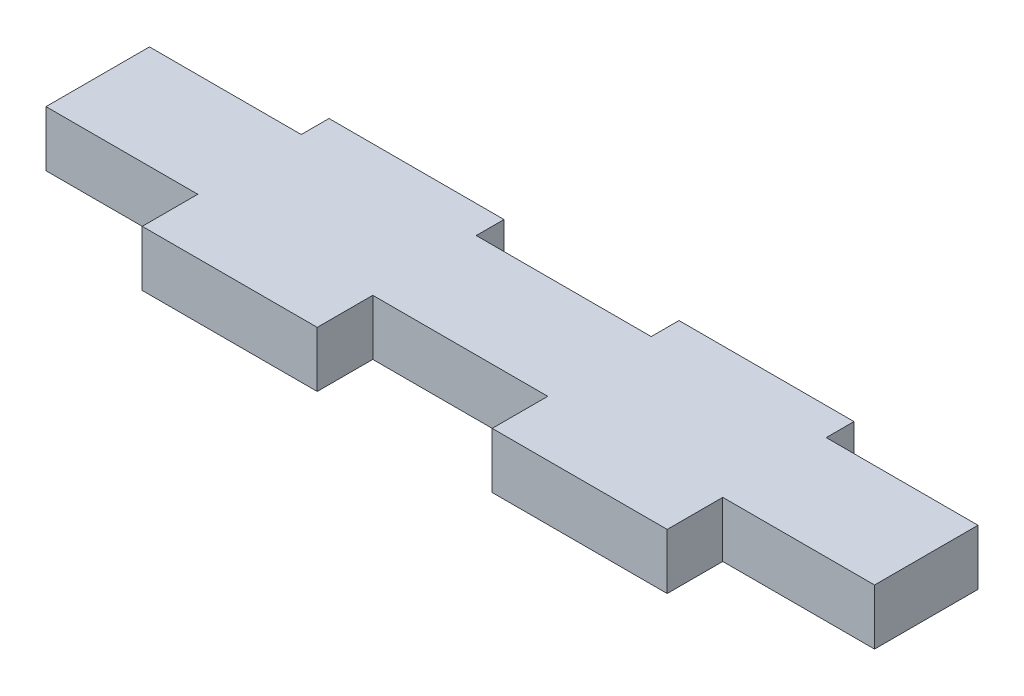
ISO-10303-21;
HEADER;
FILE_DESCRIPTION(('STEP AP214'),'2;1');
FILE_NAME('part.step','',(''),(''),'','','');
FILE_SCHEMA(('AUTOMOTIVE_DESIGN { 1 0 10303 214 1 1 1 1 }'));
ENDSEC;
DATA;
#1=APPLICATION_CONTEXT('core data for automotive mechanical design processes');
#2=APPLICATION_PROTOCOL_DEFINITION('international standard','automotive_design',2000,#1);
#3=PRODUCT_CONTEXT('',#1,'mechanical');
#4=PRODUCT('Part','Part','',(#3));
#5=PRODUCT_RELATED_PRODUCT_CATEGORY('part','',(#4));
#6=PRODUCT_DEFINITION_FORMATION('','',#4);
#7=PRODUCT_DEFINITION_CONTEXT('part definition',#1,'design');
#8=PRODUCT_DEFINITION('design','',#6,#7);
#9=PRODUCT_DEFINITION_SHAPE('','',#8);
#10=(LENGTH_UNIT() NAMED_UNIT(*) SI_UNIT(.MILLI.,.METRE.));
#11=(NAMED_UNIT(*) PLANE_ANGLE_UNIT() SI_UNIT($,.RADIAN.));
#12=(NAMED_UNIT(*) SI_UNIT($,.STERADIAN.) SOLID_ANGLE_UNIT());
#13=UNCERTAINTY_MEASURE_WITH_UNIT(LENGTH_MEASURE(1.E-05),#10,'distance_accuracy_value','');
#14=(GEOMETRIC_REPRESENTATION_CONTEXT(3) GLOBAL_UNCERTAINTY_ASSIGNED_CONTEXT((#13)) GLOBAL_UNIT_ASSIGNED_CONTEXT((#10,
#11,#12)) REPRESENTATION_CONTEXT('',''));
#15=CARTESIAN_POINT('',(0.,0.,0.));
#16=DIRECTION('',(0.,0.,1.));
#17=DIRECTION('',(1.,0.,0.));
#18=AXIS2_PLACEMENT_3D('',#15,#16,#17);
#19=CARTESIAN_POINT('',(0.,3.175,0.));
#20=DIRECTION('',(0.,0.,-1.));
#21=DIRECTION('',(-1.,0.,0.));
#22=AXIS2_PLACEMENT_3D('',#19,#20,#21);
#23=PLANE('',#22);
#24=DIRECTION('',(1.,0.,0.));
#25=VECTOR('',#24,1.);
#26=CARTESIAN_POINT('',(0.,3.175,0.));
#27=LINE('',#26,#25);
#28=CARTESIAN_POINT('',(28.6749999999999,3.175,0.));
#29=VERTEX_POINT('',#28);
#30=CARTESIAN_POINT('',(38.6749999999999,3.175,0.));
#31=VERTEX_POINT('',#30);
#32=EDGE_CURVE('E187',#29,#31,#27,.T.);
#33=ORIENTED_EDGE('',*,*,#32,.F.);
#34=DIRECTION('',(0.,-1.,0.));
#35=VECTOR('',#34,1.);
#36=CARTESIAN_POINT('',(28.6749999999999,3.175,0.));
#37=LINE('',#36,#35);
#38=CARTESIAN_POINT('',(28.6749999999999,0.,0.));
#39=VERTEX_POINT('',#38);
#40=EDGE_CURVE('E171',#29,#39,#37,.T.);
#41=ORIENTED_EDGE('',*,*,#40,.T.);
#42=DIRECTION('',(1.,0.,0.));
#43=VECTOR('',#42,1.);
#44=CARTESIAN_POINT('',(0.,0.,0.));
#45=LINE('',#44,#43);
#46=CARTESIAN_POINT('',(38.6749999999999,0.,0.));
#47=VERTEX_POINT('',#46);
#48=EDGE_CURVE('E213',#39,#47,#45,.T.);
#49=ORIENTED_EDGE('',*,*,#48,.T.);
#50=DIRECTION('',(0.,-1.,0.));
#51=VECTOR('',#50,1.);
#52=CARTESIAN_POINT('',(38.6749999999999,3.175,0.));
#53=LINE('',#52,#51);
#54=EDGE_CURVE('E196',#31,#47,#53,.T.);
#55=ORIENTED_EDGE('',*,*,#54,.F.);
#56=EDGE_LOOP('',(#33,#41,#49,#55));
#57=FACE_BOUND('',#56,.T.);
#58=ADVANCED_FACE('F32',(#57),#23,.F.);
#59=CARTESIAN_POINT('',(0.,3.175,-10.675));
#60=DIRECTION('',(0.,0.,1.));
#61=DIRECTION('',(1.,0.,0.));
#62=AXIS2_PLACEMENT_3D('',#59,#60,#61);
#63=PLANE('',#62);
#64=DIRECTION('',(-1.,0.,0.));
#65=VECTOR('',#64,1.);
#66=CARTESIAN_POINT('',(0.,3.175,-10.675));
#67=LINE('',#66,#65);
#68=CARTESIAN_POINT('',(38.6749999999999,3.175,-10.675));
#69=VERTEX_POINT('',#68);
#70=CARTESIAN_POINT('',(28.6749999999999,3.175,-10.675));
#71=VERTEX_POINT('',#70);
#72=EDGE_CURVE('E11',#69,#71,#67,.T.);
#73=ORIENTED_EDGE('',*,*,#72,.F.);
#74=DIRECTION('',(0.,-1.,0.));
#75=VECTOR('',#74,1.);
#76=CARTESIAN_POINT('',(38.6749999999999,3.175,-10.675));
#77=LINE('',#76,#75);
#78=CARTESIAN_POINT('',(38.6749999999999,0.,-10.675));
#79=VERTEX_POINT('',#78);
#80=EDGE_CURVE('E262',#69,#79,#77,.T.);
#81=ORIENTED_EDGE('',*,*,#80,.T.);
#82=DIRECTION('',(-1.,0.,0.));
#83=VECTOR('',#82,1.);
#84=CARTESIAN_POINT('',(0.,0.,-10.675));
#85=LINE('',#84,#83);
#86=CARTESIAN_POINT('',(28.6749999999999,0.,-10.675));
#87=VERTEX_POINT('',#86);
#88=EDGE_CURVE('E203',#79,#87,#85,.T.);
#89=ORIENTED_EDGE('',*,*,#88,.T.);
#90=DIRECTION('',(0.,-1.,0.));
#91=VECTOR('',#90,1.);
#92=CARTESIAN_POINT('',(28.6749999999999,3.175,-10.675));
#93=LINE('',#92,#91);
#94=EDGE_CURVE('E280',#71,#87,#93,.T.);
#95=ORIENTED_EDGE('',*,*,#94,.F.);
#96=EDGE_LOOP('',(#73,#81,#89,#95));
#97=FACE_BOUND('',#96,.T.);
#98=ADVANCED_FACE('F357',(#97),#63,.F.);
#99=CARTESIAN_POINT('',(0.,3.175,0.));
#100=DIRECTION('',(1.,0.,0.));
#101=DIRECTION('',(0.,0.,-1.));
#102=AXIS2_PLACEMENT_3D('',#99,#100,#101);
#103=PLANE('',#102);
#104=DIRECTION('',(0.,0.,1.));
#105=VECTOR('',#104,1.);
#106=CARTESIAN_POINT('',(0.,0.,0.));
#107=LINE('',#106,#105);
#108=CARTESIAN_POINT('',(0.,0.,-9.0875000000001));
#109=VERTEX_POINT('',#108);
#110=CARTESIAN_POINT('',(0.,0.,-3.17499999999978));
#111=VERTEX_POINT('',#110);
#112=EDGE_CURVE('E210',#109,#111,#107,.T.);
#113=ORIENTED_EDGE('',*,*,#112,.T.);
#114=DIRECTION('',(0.,-1.,0.));
#115=VECTOR('',#114,1.);
#116=CARTESIAN_POINT('',(0.,3.175,-3.17499999999979));
#117=LINE('',#116,#115);
#118=CARTESIAN_POINT('',(0.,3.175,-3.17499999999979));
#119=VERTEX_POINT('',#118);
#120=EDGE_CURVE('E266',#119,#111,#117,.T.);
#121=ORIENTED_EDGE('',*,*,#120,.F.);
#122=DIRECTION('',(0.,0.,1.));
#123=VECTOR('',#122,1.);
#124=CARTESIAN_POINT('',(0.,3.175,0.));
#125=LINE('',#124,#123);
#126=CARTESIAN_POINT('',(0.,3.175,-9.0875000000001));
#127=VERTEX_POINT('',#126);
#128=EDGE_CURVE('E198',#127,#119,#125,.T.);
#129=ORIENTED_EDGE('',*,*,#128,.F.);
#130=DIRECTION('',(0.,-1.,0.));
#131=VECTOR('',#130,1.);
#132=CARTESIAN_POINT('',(0.,3.175,-9.0875000000001));
#133=LINE('',#132,#131);
#134=EDGE_CURVE('E322',#127,#109,#133,.T.);
#135=ORIENTED_EDGE('',*,*,#134,.T.);
#136=EDGE_LOOP('',(#113,#121,#129,#135));
#137=FACE_BOUND('',#136,.T.);
#138=ADVANCED_FACE('F34',(#137),#103,.F.);
#139=CARTESIAN_POINT('',(8.6749999999999,0.,0.));
#140=VERTEX_POINT('',#139);
#141=CARTESIAN_POINT('',(18.6749999999999,0.,0.));
#142=VERTEX_POINT('',#141);
#143=EDGE_CURVE('E215',#140,#142,#45,.T.);
#144=ORIENTED_EDGE('',*,*,#143,.T.);
#145=DIRECTION('',(0.,-1.,0.));
#146=VECTOR('',#145,1.);
#147=CARTESIAN_POINT('',(18.6749999999999,3.175,0.));
#148=LINE('',#147,#146);
#149=CARTESIAN_POINT('',(18.6749999999999,3.175,0.));
#150=VERTEX_POINT('',#149);
#151=EDGE_CURVE('E181',#150,#142,#148,.T.);
#152=ORIENTED_EDGE('',*,*,#151,.F.);
#153=CARTESIAN_POINT('',(8.6749999999999,3.175,0.));
#154=VERTEX_POINT('',#153);
#155=EDGE_CURVE('E197',#154,#150,#27,.T.);
#156=ORIENTED_EDGE('',*,*,#155,.F.);
#157=DIRECTION('',(0.,-1.,0.));
#158=VECTOR('',#157,1.);
#159=CARTESIAN_POINT('',(8.6749999999999,3.175,0.));
#160=LINE('',#159,#158);
#161=EDGE_CURVE('E230',#154,#140,#160,.T.);
#162=ORIENTED_EDGE('',*,*,#161,.T.);
#163=EDGE_LOOP('',(#144,#152,#156,#162));
#164=FACE_BOUND('',#163,.T.);
#165=ADVANCED_FACE('F228',(#164),#23,.F.);
#166=CARTESIAN_POINT('',(47.35,3.175,0.));
#167=DIRECTION('',(-1.,0.,0.));
#168=DIRECTION('',(0.,0.,1.));
#169=AXIS2_PLACEMENT_3D('',#166,#167,#168);
#170=PLANE('',#169);
#171=DIRECTION('',(0.,0.,-1.));
#172=VECTOR('',#171,1.);
#173=CARTESIAN_POINT('',(47.35,0.,0.));
#174=LINE('',#173,#172);
#175=CARTESIAN_POINT('',(47.35,0.,-3.17499999999989));
#176=VERTEX_POINT('',#175);
#177=CARTESIAN_POINT('',(47.35,0.,-9.08750000000009));
#178=VERTEX_POINT('',#177);
#179=EDGE_CURVE('E216',#176,#178,#174,.T.);
#180=ORIENTED_EDGE('',*,*,#179,.T.);
#181=DIRECTION('',(0.,-1.,0.));
#182=VECTOR('',#181,1.);
#183=CARTESIAN_POINT('',(47.35,3.175,-9.0875000000001));
#184=LINE('',#183,#182);
#185=CARTESIAN_POINT('',(47.35,3.175,-9.0875000000001));
#186=VERTEX_POINT('',#185);
#187=EDGE_CURVE('E276',#186,#178,#184,.T.);
#188=ORIENTED_EDGE('',*,*,#187,.F.);
#189=DIRECTION('',(0.,0.,-1.));
#190=VECTOR('',#189,1.);
#191=CARTESIAN_POINT('',(47.35,3.175,0.));
#192=LINE('',#191,#190);
#193=CARTESIAN_POINT('',(47.35,3.175,-3.17499999999989));
#194=VERTEX_POINT('',#193);
#195=EDGE_CURVE('E201',#194,#186,#192,.T.);
#196=ORIENTED_EDGE('',*,*,#195,.F.);
#197=DIRECTION('',(0.,-1.,0.));
#198=VECTOR('',#197,1.);
#199=CARTESIAN_POINT('',(47.35,3.175,-3.17499999999989));
#200=LINE('',#199,#198);
#201=EDGE_CURVE('E214',#194,#176,#200,.T.);
#202=ORIENTED_EDGE('',*,*,#201,.T.);
#203=EDGE_LOOP('',(#180,#188,#196,#202));
#204=FACE_BOUND('',#203,.T.);
#205=ADVANCED_FACE('F346',(#204),#170,.F.);
#206=CARTESIAN_POINT('',(18.6749999999999,3.175,-10.675));
#207=VERTEX_POINT('',#206);
#208=CARTESIAN_POINT('',(8.6749999999999,3.175,-10.675));
#209=VERTEX_POINT('',#208);
#210=EDGE_CURVE('E41',#207,#209,#67,.T.);
#211=ORIENTED_EDGE('',*,*,#210,.F.);
#212=DIRECTION('',(0.,-1.,0.));
#213=VECTOR('',#212,1.);
#214=CARTESIAN_POINT('',(18.6749999999999,3.175,-10.675));
#215=LINE('',#214,#213);
#216=CARTESIAN_POINT('',(18.6749999999999,0.,-10.675));
#217=VERTEX_POINT('',#216);
#218=EDGE_CURVE('E305',#207,#217,#215,.T.);
#219=ORIENTED_EDGE('',*,*,#218,.T.);
#220=CARTESIAN_POINT('',(8.6749999999999,0.,-10.675));
#221=VERTEX_POINT('',#220);
#222=EDGE_CURVE('E36',#217,#221,#85,.T.);
#223=ORIENTED_EDGE('',*,*,#222,.T.);
#224=DIRECTION('',(0.,-1.,0.));
#225=VECTOR('',#224,1.);
#226=CARTESIAN_POINT('',(8.6749999999999,3.175,-10.675));
#227=LINE('',#226,#225);
#228=EDGE_CURVE('E300',#209,#221,#227,.T.);
#229=ORIENTED_EDGE('',*,*,#228,.F.);
#230=EDGE_LOOP('',(#211,#219,#223,#229));
#231=FACE_BOUND('',#230,.T.);
#232=ADVANCED_FACE('F371',(#231),#63,.F.);
#233=CARTESIAN_POINT('',(0.,3.175,0.));
#234=DIRECTION('',(0.,-1.,0.));
#235=DIRECTION('',(0.,0.,-1.));
#236=AXIS2_PLACEMENT_3D('',#233,#234,#235);
#237=PLANE('',#236);
#238=DIRECTION('',(1.,0.,0.));
#239=VECTOR('',#238,1.);
#240=CARTESIAN_POINT('',(28.6749999999999,3.175,-3.17499999999982));
#241=LINE('',#240,#239);
#242=CARTESIAN_POINT('',(18.6749999999999,3.175,-3.17499999999982));
#243=VERTEX_POINT('',#242);
#244=CARTESIAN_POINT('',(28.6749999999999,3.175,-3.17499999999982));
#245=VERTEX_POINT('',#244);
#246=EDGE_CURVE('E182',#243,#245,#241,.T.);
#247=ORIENTED_EDGE('',*,*,#246,.T.);
#248=DIRECTION('',(0.,0.,1.));
#249=VECTOR('',#248,1.);
#250=CARTESIAN_POINT('',(28.6749999999999,3.175,0.));
#251=LINE('',#250,#249);
#252=EDGE_CURVE('E174',#245,#29,#251,.T.);
#253=ORIENTED_EDGE('',*,*,#252,.T.);
#254=ORIENTED_EDGE('',*,*,#32,.T.);
#255=DIRECTION('',(0.,0.,-1.));
#256=VECTOR('',#255,1.);
#257=CARTESIAN_POINT('',(38.6749999999999,3.175,0.));
#258=LINE('',#257,#256);
#259=CARTESIAN_POINT('',(38.6749999999999,3.175,-3.17499999999989));
#260=VERTEX_POINT('',#259);
#261=EDGE_CURVE('E326',#31,#260,#258,.T.);
#262=ORIENTED_EDGE('',*,*,#261,.T.);
#263=DIRECTION('',(1.,0.,0.));
#264=VECTOR('',#263,1.);
#265=CARTESIAN_POINT('',(47.35,3.175,-3.17499999999989));
#266=LINE('',#265,#264);
#267=EDGE_CURVE('E328',#260,#194,#266,.T.);
#268=ORIENTED_EDGE('',*,*,#267,.T.);
#269=ORIENTED_EDGE('',*,*,#195,.T.);
#270=DIRECTION('',(-1.,0.,0.));
#271=VECTOR('',#270,1.);
#272=CARTESIAN_POINT('',(47.35,3.175,-9.0875000000001));
#273=LINE('',#272,#271);
#274=CARTESIAN_POINT('',(38.6749999999999,3.175,-9.0875000000001));
#275=VERTEX_POINT('',#274);
#276=EDGE_CURVE('E269',#186,#275,#273,.T.);
#277=ORIENTED_EDGE('',*,*,#276,.T.);
#278=DIRECTION('',(0.,0.,-1.));
#279=VECTOR('',#278,1.);
#280=CARTESIAN_POINT('',(38.6749999999999,3.175,-10.675));
#281=LINE('',#280,#279);
#282=EDGE_CURVE('E272',#275,#69,#281,.T.);
#283=ORIENTED_EDGE('',*,*,#282,.T.);
#284=ORIENTED_EDGE('',*,*,#72,.T.);
#285=DIRECTION('',(0.,0.,1.));
#286=VECTOR('',#285,1.);
#287=CARTESIAN_POINT('',(28.6749999999999,3.175,-10.675));
#288=LINE('',#287,#286);
#289=CARTESIAN_POINT('',(28.6749999999999,3.175,-9.0875000000001));
#290=VERTEX_POINT('',#289);
#291=EDGE_CURVE('E287',#71,#290,#288,.T.);
#292=ORIENTED_EDGE('',*,*,#291,.T.);
#293=DIRECTION('',(-1.,0.,0.));
#294=VECTOR('',#293,1.);
#295=CARTESIAN_POINT('',(28.6749999999999,3.175,-9.0875000000001));
#296=LINE('',#295,#294);
#297=CARTESIAN_POINT('',(18.6749999999999,3.175,-9.0875000000001));
#298=VERTEX_POINT('',#297);
#299=EDGE_CURVE('E290',#290,#298,#296,.T.);
#300=ORIENTED_EDGE('',*,*,#299,.T.);
#301=DIRECTION('',(0.,0.,-1.));
#302=VECTOR('',#301,1.);
#303=CARTESIAN_POINT('',(18.6749999999999,3.175,-10.675));
#304=LINE('',#303,#302);
#305=EDGE_CURVE('E294',#298,#207,#304,.T.);
#306=ORIENTED_EDGE('',*,*,#305,.T.);
#307=ORIENTED_EDGE('',*,*,#210,.T.);
#308=DIRECTION('',(0.,0.,1.));
#309=VECTOR('',#308,1.);
#310=CARTESIAN_POINT('',(8.6749999999999,3.175,-10.675));
#311=LINE('',#310,#309);
#312=CARTESIAN_POINT('',(8.6749999999999,3.175,-9.0875000000001));
#313=VERTEX_POINT('',#312);
#314=EDGE_CURVE('E311',#209,#313,#311,.T.);
#315=ORIENTED_EDGE('',*,*,#314,.T.);
#316=DIRECTION('',(-1.,0.,0.));
#317=VECTOR('',#316,1.);
#318=CARTESIAN_POINT('',(8.6749999999999,3.175,-9.0875000000001));
#319=LINE('',#318,#317);
#320=EDGE_CURVE('E314',#313,#127,#319,.T.);
#321=ORIENTED_EDGE('',*,*,#320,.T.);
#322=ORIENTED_EDGE('',*,*,#128,.T.);
#323=DIRECTION('',(1.,0.,0.));
#324=VECTOR('',#323,1.);
#325=CARTESIAN_POINT('',(8.6749999999999,3.175,-3.17499999999979));
#326=LINE('',#325,#324);
#327=CARTESIAN_POINT('',(8.6749999999999,3.175,-3.17499999999979));
#328=VERTEX_POINT('',#327);
#329=EDGE_CURVE('E257',#119,#328,#326,.T.);
#330=ORIENTED_EDGE('',*,*,#329,.T.);
#331=DIRECTION('',(0.,0.,1.));
#332=VECTOR('',#331,1.);
#333=CARTESIAN_POINT('',(8.6749999999999,3.175,-3.17499999999979));
#334=LINE('',#333,#332);
#335=EDGE_CURVE('E254',#328,#154,#334,.T.);
#336=ORIENTED_EDGE('',*,*,#335,.T.);
#337=ORIENTED_EDGE('',*,*,#155,.T.);
#338=DIRECTION('',(0.,0.,-1.));
#339=VECTOR('',#338,1.);
#340=CARTESIAN_POINT('',(18.6749999999999,3.175,0.));
#341=LINE('',#340,#339);
#342=EDGE_CURVE('E191',#150,#243,#341,.T.);
#343=ORIENTED_EDGE('',*,*,#342,.T.);
#344=EDGE_LOOP('',(#247,#253,#254,#262,#268,#269,#277,#283,#284,#292,#300,#306,#307,#315,#321,
#322,#330,#336,#337,#343));
#345=FACE_BOUND('',#344,.T.);
#346=ADVANCED_FACE('F185',(#345),#237,.F.);
#347=CARTESIAN_POINT('',(0.,0.,0.));
#348=DIRECTION('',(0.,-1.,0.));
#349=DIRECTION('',(0.,0.,-1.));
#350=AXIS2_PLACEMENT_3D('',#347,#348,#349);
#351=PLANE('',#350);
#352=DIRECTION('',(0.,0.,1.));
#353=VECTOR('',#352,1.);
#354=CARTESIAN_POINT('',(28.6749999999999,0.,0.));
#355=LINE('',#354,#353);
#356=CARTESIAN_POINT('',(28.6749999999999,0.,-3.17499999999982));
#357=VERTEX_POINT('',#356);
#358=EDGE_CURVE('E177',#357,#39,#355,.T.);
#359=ORIENTED_EDGE('',*,*,#358,.F.);
#360=DIRECTION('',(1.,0.,0.));
#361=VECTOR('',#360,1.);
#362=CARTESIAN_POINT('',(28.6749999999999,0.,-3.17499999999982));
#363=LINE('',#362,#361);
#364=CARTESIAN_POINT('',(18.6749999999999,0.,-3.17499999999982));
#365=VERTEX_POINT('',#364);
#366=EDGE_CURVE('E192',#365,#357,#363,.T.);
#367=ORIENTED_EDGE('',*,*,#366,.F.);
#368=DIRECTION('',(0.,0.,-1.));
#369=VECTOR('',#368,1.);
#370=CARTESIAN_POINT('',(18.6749999999999,0.,0.));
#371=LINE('',#370,#369);
#372=EDGE_CURVE('E239',#142,#365,#371,.T.);
#373=ORIENTED_EDGE('',*,*,#372,.F.);
#374=ORIENTED_EDGE('',*,*,#143,.F.);
#375=DIRECTION('',(0.,0.,1.));
#376=VECTOR('',#375,1.);
#377=CARTESIAN_POINT('',(8.6749999999999,0.,-3.17499999999979));
#378=LINE('',#377,#376);
#379=CARTESIAN_POINT('',(8.6749999999999,0.,-3.17499999999979));
#380=VERTEX_POINT('',#379);
#381=EDGE_CURVE('E236',#380,#140,#378,.T.);
#382=ORIENTED_EDGE('',*,*,#381,.F.);
#383=DIRECTION('',(1.,0.,0.));
#384=VECTOR('',#383,1.);
#385=CARTESIAN_POINT('',(8.6749999999999,0.,-3.17499999999979));
#386=LINE('',#385,#384);
#387=EDGE_CURVE('E258',#111,#380,#386,.T.);
#388=ORIENTED_EDGE('',*,*,#387,.F.);
#389=ORIENTED_EDGE('',*,*,#112,.F.);
#390=DIRECTION('',(-1.,0.,0.));
#391=VECTOR('',#390,1.);
#392=CARTESIAN_POINT('',(8.6749999999999,0.,-9.0875000000001));
#393=LINE('',#392,#391);
#394=CARTESIAN_POINT('',(8.6749999999999,0.,-9.0875000000001));
#395=VERTEX_POINT('',#394);
#396=EDGE_CURVE('E315',#395,#109,#393,.T.);
#397=ORIENTED_EDGE('',*,*,#396,.F.);
#398=DIRECTION('',(0.,0.,1.));
#399=VECTOR('',#398,1.);
#400=CARTESIAN_POINT('',(8.6749999999999,0.,-10.675));
#401=LINE('',#400,#399);
#402=EDGE_CURVE('E57',#221,#395,#401,.T.);
#403=ORIENTED_EDGE('',*,*,#402,.F.);
#404=ORIENTED_EDGE('',*,*,#222,.F.);
#405=DIRECTION('',(0.,0.,-1.));
#406=VECTOR('',#405,1.);
#407=CARTESIAN_POINT('',(18.6749999999999,0.,-10.675));
#408=LINE('',#407,#406);
#409=CARTESIAN_POINT('',(18.6749999999999,0.,-9.0875000000001));
#410=VERTEX_POINT('',#409);
#411=EDGE_CURVE('E291',#410,#217,#408,.T.);
#412=ORIENTED_EDGE('',*,*,#411,.F.);
#413=DIRECTION('',(-1.,0.,0.));
#414=VECTOR('',#413,1.);
#415=CARTESIAN_POINT('',(28.6749999999999,0.,-9.0875000000001));
#416=LINE('',#415,#414);
#417=CARTESIAN_POINT('',(28.6749999999999,0.,-9.0875000000001));
#418=VERTEX_POINT('',#417);
#419=EDGE_CURVE('E299',#418,#410,#416,.T.);
#420=ORIENTED_EDGE('',*,*,#419,.F.);
#421=DIRECTION('',(0.,0.,1.));
#422=VECTOR('',#421,1.);
#423=CARTESIAN_POINT('',(28.6749999999999,0.,-10.675));
#424=LINE('',#423,#422);
#425=EDGE_CURVE('E49',#87,#418,#424,.T.);
#426=ORIENTED_EDGE('',*,*,#425,.F.);
#427=ORIENTED_EDGE('',*,*,#88,.F.);
#428=DIRECTION('',(0.,0.,-1.));
#429=VECTOR('',#428,1.);
#430=CARTESIAN_POINT('',(38.6749999999999,0.,-10.675));
#431=LINE('',#430,#429);
#432=CARTESIAN_POINT('',(38.6749999999999,0.,-9.0875000000001));
#433=VERTEX_POINT('',#432);
#434=EDGE_CURVE('E273',#433,#79,#431,.T.);
#435=ORIENTED_EDGE('',*,*,#434,.F.);
#436=DIRECTION('',(-1.,0.,0.));
#437=VECTOR('',#436,1.);
#438=CARTESIAN_POINT('',(47.35,0.,-9.0875000000001));
#439=LINE('',#438,#437);
#440=EDGE_CURVE('E277',#178,#433,#439,.T.);
#441=ORIENTED_EDGE('',*,*,#440,.F.);
#442=ORIENTED_EDGE('',*,*,#179,.F.);
#443=DIRECTION('',(1.,0.,0.));
#444=VECTOR('',#443,1.);
#445=CARTESIAN_POINT('',(47.35,0.,-3.17499999999989));
#446=LINE('',#445,#444);
#447=CARTESIAN_POINT('',(38.6749999999999,0.,-3.17499999999989));
#448=VERTEX_POINT('',#447);
#449=EDGE_CURVE('E329',#448,#176,#446,.T.);
#450=ORIENTED_EDGE('',*,*,#449,.F.);
#451=DIRECTION('',(0.,0.,-1.));
#452=VECTOR('',#451,1.);
#453=CARTESIAN_POINT('',(38.6749999999999,0.,0.));
#454=LINE('',#453,#452);
#455=EDGE_CURVE('E250',#47,#448,#454,.T.);
#456=ORIENTED_EDGE('',*,*,#455,.F.);
#457=ORIENTED_EDGE('',*,*,#48,.F.);
#458=EDGE_LOOP('',(#359,#367,#373,#374,#382,#388,#389,#397,#403,#404,#412,#420,#426,#427,#435,
#441,#442,#450,#456,#457));
#459=FACE_BOUND('',#458,.T.);
#460=ADVANCED_FACE('F234',(#459),#351,.T.);
#461=CARTESIAN_POINT('',(47.35,3.175,-3.17499999999989));
#462=DIRECTION('',(0.,0.,-1.));
#463=DIRECTION('',(-1.,0.,0.));
#464=AXIS2_PLACEMENT_3D('',#461,#462,#463);
#465=PLANE('',#464);
#466=ORIENTED_EDGE('',*,*,#449,.T.);
#467=ORIENTED_EDGE('',*,*,#201,.F.);
#468=ORIENTED_EDGE('',*,*,#267,.F.);
#469=DIRECTION('',(0.,-1.,0.));
#470=VECTOR('',#469,1.);
#471=CARTESIAN_POINT('',(38.6749999999999,3.175,-3.17499999999989));
#472=LINE('',#471,#470);
#473=EDGE_CURVE('E336',#260,#448,#472,.T.);
#474=ORIENTED_EDGE('',*,*,#473,.T.);
#475=EDGE_LOOP('',(#466,#467,#468,#474));
#476=FACE_BOUND('',#475,.T.);
#477=ADVANCED_FACE('F343',(#476),#465,.F.);
#478=CARTESIAN_POINT('',(38.6749999999999,3.175,0.));
#479=DIRECTION('',(-1.,0.,0.));
#480=DIRECTION('',(0.,0.,1.));
#481=AXIS2_PLACEMENT_3D('',#478,#479,#480);
#482=PLANE('',#481);
#483=ORIENTED_EDGE('',*,*,#455,.T.);
#484=ORIENTED_EDGE('',*,*,#473,.F.);
#485=ORIENTED_EDGE('',*,*,#261,.F.);
#486=ORIENTED_EDGE('',*,*,#54,.T.);
#487=EDGE_LOOP('',(#483,#484,#485,#486));
#488=FACE_BOUND('',#487,.T.);
#489=ADVANCED_FACE('F339',(#488),#482,.F.);
#490=CARTESIAN_POINT('',(8.6749999999999,3.175,-10.675));
#491=DIRECTION('',(1.,0.,0.));
#492=DIRECTION('',(0.,0.,-1.));
#493=AXIS2_PLACEMENT_3D('',#490,#491,#492);
#494=PLANE('',#493);
#495=ORIENTED_EDGE('',*,*,#402,.T.);
#496=DIRECTION('',(0.,-1.,0.));
#497=VECTOR('',#496,1.);
#498=CARTESIAN_POINT('',(8.6749999999999,3.175,-9.0875000000001));
#499=LINE('',#498,#497);
#500=EDGE_CURVE('E318',#313,#395,#499,.T.);
#501=ORIENTED_EDGE('',*,*,#500,.F.);
#502=ORIENTED_EDGE('',*,*,#314,.F.);
#503=ORIENTED_EDGE('',*,*,#228,.T.);
#504=EDGE_LOOP('',(#495,#501,#502,#503));
#505=FACE_BOUND('',#504,.T.);
#506=ADVANCED_FACE('F372',(#505),#494,.F.);
#507=CARTESIAN_POINT('',(8.6749999999999,3.175,-9.0875000000001));
#508=DIRECTION('',(0.,0.,1.));
#509=DIRECTION('',(1.,0.,0.));
#510=AXIS2_PLACEMENT_3D('',#507,#508,#509);
#511=PLANE('',#510);
#512=ORIENTED_EDGE('',*,*,#396,.T.);
#513=ORIENTED_EDGE('',*,*,#134,.F.);
#514=ORIENTED_EDGE('',*,*,#320,.F.);
#515=ORIENTED_EDGE('',*,*,#500,.T.);
#516=EDGE_LOOP('',(#512,#513,#514,#515));
#517=FACE_BOUND('',#516,.T.);
#518=ADVANCED_FACE('F376',(#517),#511,.F.);
#519=CARTESIAN_POINT('',(28.6749999999999,3.175,-10.675));
#520=DIRECTION('',(1.,0.,0.));
#521=DIRECTION('',(0.,0.,-1.));
#522=AXIS2_PLACEMENT_3D('',#519,#520,#521);
#523=PLANE('',#522);
#524=ORIENTED_EDGE('',*,*,#425,.T.);
#525=DIRECTION('',(0.,-1.,0.));
#526=VECTOR('',#525,1.);
#527=CARTESIAN_POINT('',(28.6749999999999,3.175,-9.0875000000001));
#528=LINE('',#527,#526);
#529=EDGE_CURVE('E297',#290,#418,#528,.T.);
#530=ORIENTED_EDGE('',*,*,#529,.F.);
#531=ORIENTED_EDGE('',*,*,#291,.F.);
#532=ORIENTED_EDGE('',*,*,#94,.T.);
#533=EDGE_LOOP('',(#524,#530,#531,#532));
#534=FACE_BOUND('',#533,.T.);
#535=ADVANCED_FACE('F366',(#534),#523,.F.);
#536=CARTESIAN_POINT('',(18.6749999999999,3.175,-10.675));
#537=DIRECTION('',(-1.,0.,0.));
#538=DIRECTION('',(0.,0.,1.));
#539=AXIS2_PLACEMENT_3D('',#536,#537,#538);
#540=PLANE('',#539);
#541=ORIENTED_EDGE('',*,*,#411,.T.);
#542=ORIENTED_EDGE('',*,*,#218,.F.);
#543=ORIENTED_EDGE('',*,*,#305,.F.);
#544=DIRECTION('',(0.,-1.,0.));
#545=VECTOR('',#544,1.);
#546=CARTESIAN_POINT('',(18.6749999999999,3.175,-9.0875000000001));
#547=LINE('',#546,#545);
#548=EDGE_CURVE('E308',#298,#410,#547,.T.);
#549=ORIENTED_EDGE('',*,*,#548,.T.);
#550=EDGE_LOOP('',(#541,#542,#543,#549));
#551=FACE_BOUND('',#550,.T.);
#552=ADVANCED_FACE('F456',(#551),#540,.F.);
#553=CARTESIAN_POINT('',(28.6749999999999,3.175,-9.0875000000001));
#554=DIRECTION('',(0.,0.,1.));
#555=DIRECTION('',(1.,0.,0.));
#556=AXIS2_PLACEMENT_3D('',#553,#554,#555);
#557=PLANE('',#556);
#558=ORIENTED_EDGE('',*,*,#419,.T.);
#559=ORIENTED_EDGE('',*,*,#548,.F.);
#560=ORIENTED_EDGE('',*,*,#299,.F.);
#561=ORIENTED_EDGE('',*,*,#529,.T.);
#562=EDGE_LOOP('',(#558,#559,#560,#561));
#563=FACE_BOUND('',#562,.T.);
#564=ADVANCED_FACE('F363',(#563),#557,.F.);
#565=CARTESIAN_POINT('',(38.6749999999999,3.175,-10.675));
#566=DIRECTION('',(-1.,0.,0.));
#567=DIRECTION('',(0.,0.,1.));
#568=AXIS2_PLACEMENT_3D('',#565,#566,#567);
#569=PLANE('',#568);
#570=ORIENTED_EDGE('',*,*,#434,.T.);
#571=ORIENTED_EDGE('',*,*,#80,.F.);
#572=ORIENTED_EDGE('',*,*,#282,.F.);
#573=DIRECTION('',(0.,-1.,0.));
#574=VECTOR('',#573,1.);
#575=CARTESIAN_POINT('',(38.6749999999999,3.175,-9.0875000000001));
#576=LINE('',#575,#574);
#577=EDGE_CURVE('E284',#275,#433,#576,.T.);
#578=ORIENTED_EDGE('',*,*,#577,.T.);
#579=EDGE_LOOP('',(#570,#571,#572,#578));
#580=FACE_BOUND('',#579,.T.);
#581=ADVANCED_FACE('F353',(#580),#569,.F.);
#582=CARTESIAN_POINT('',(47.35,3.175,-9.0875000000001));
#583=DIRECTION('',(0.,0.,1.));
#584=DIRECTION('',(1.,0.,0.));
#585=AXIS2_PLACEMENT_3D('',#582,#583,#584);
#586=PLANE('',#585);
#587=ORIENTED_EDGE('',*,*,#440,.T.);
#588=ORIENTED_EDGE('',*,*,#577,.F.);
#589=ORIENTED_EDGE('',*,*,#276,.F.);
#590=ORIENTED_EDGE('',*,*,#187,.T.);
#591=EDGE_LOOP('',(#587,#588,#589,#590));
#592=FACE_BOUND('',#591,.T.);
#593=ADVANCED_FACE('F350',(#592),#586,.F.);
#594=CARTESIAN_POINT('',(8.6749999999999,3.175,-3.17499999999979));
#595=DIRECTION('',(1.,0.,0.));
#596=DIRECTION('',(0.,0.,-1.));
#597=AXIS2_PLACEMENT_3D('',#594,#595,#596);
#598=PLANE('',#597);
#599=ORIENTED_EDGE('',*,*,#381,.T.);
#600=ORIENTED_EDGE('',*,*,#161,.F.);
#601=ORIENTED_EDGE('',*,*,#335,.F.);
#602=DIRECTION('',(0.,-1.,0.));
#603=VECTOR('',#602,1.);
#604=CARTESIAN_POINT('',(8.6749999999999,3.175,-3.17499999999979));
#605=LINE('',#604,#603);
#606=EDGE_CURVE('E244',#328,#380,#605,.T.);
#607=ORIENTED_EDGE('',*,*,#606,.T.);
#608=EDGE_LOOP('',(#599,#600,#601,#607));
#609=FACE_BOUND('',#608,.T.);
#610=ADVANCED_FACE('F385',(#609),#598,.F.);
#611=CARTESIAN_POINT('',(8.6749999999999,3.175,-3.17499999999979));
#612=DIRECTION('',(0.,0.,-1.));
#613=DIRECTION('',(-1.,0.,0.));
#614=AXIS2_PLACEMENT_3D('',#611,#612,#613);
#615=PLANE('',#614);
#616=ORIENTED_EDGE('',*,*,#387,.T.);
#617=ORIENTED_EDGE('',*,*,#606,.F.);
#618=ORIENTED_EDGE('',*,*,#329,.F.);
#619=ORIENTED_EDGE('',*,*,#120,.T.);
#620=EDGE_LOOP('',(#616,#617,#618,#619));
#621=FACE_BOUND('',#620,.T.);
#622=ADVANCED_FACE('F383',(#621),#615,.F.);
#623=CARTESIAN_POINT('',(28.6749999999999,3.175,0.));
#624=DIRECTION('',(1.,0.,0.));
#625=DIRECTION('',(0.,0.,-1.));
#626=AXIS2_PLACEMENT_3D('',#623,#624,#625);
#627=PLANE('',#626);
#628=ORIENTED_EDGE('',*,*,#358,.T.);
#629=ORIENTED_EDGE('',*,*,#40,.F.);
#630=ORIENTED_EDGE('',*,*,#252,.F.);
#631=DIRECTION('',(0.,-1.,0.));
#632=VECTOR('',#631,1.);
#633=CARTESIAN_POINT('',(28.6749999999999,3.175,-3.17499999999982));
#634=LINE('',#633,#632);
#635=EDGE_CURVE('E248',#245,#357,#634,.T.);
#636=ORIENTED_EDGE('',*,*,#635,.T.);
#637=EDGE_LOOP('',(#628,#629,#630,#636));
#638=FACE_BOUND('',#637,.T.);
#639=ADVANCED_FACE('F173',(#638),#627,.F.);
#640=CARTESIAN_POINT('',(28.6749999999999,3.175,-3.17499999999982));
#641=DIRECTION('',(0.,0.,-1.));
#642=DIRECTION('',(-1.,0.,0.));
#643=AXIS2_PLACEMENT_3D('',#640,#641,#642);
#644=PLANE('',#643);
#645=ORIENTED_EDGE('',*,*,#366,.T.);
#646=ORIENTED_EDGE('',*,*,#635,.F.);
#647=ORIENTED_EDGE('',*,*,#246,.F.);
#648=DIRECTION('',(0.,-1.,0.));
#649=VECTOR('',#648,1.);
#650=CARTESIAN_POINT('',(18.6749999999999,3.175,-3.17499999999982));
#651=LINE('',#650,#649);
#652=EDGE_CURVE('E251',#243,#365,#651,.T.);
#653=ORIENTED_EDGE('',*,*,#652,.T.);
#654=EDGE_LOOP('',(#645,#646,#647,#653));
#655=FACE_BOUND('',#654,.T.);
#656=ADVANCED_FACE('F498',(#655),#644,.F.);
#657=CARTESIAN_POINT('',(18.6749999999999,3.175,0.));
#658=DIRECTION('',(-1.,0.,0.));
#659=DIRECTION('',(0.,0.,1.));
#660=AXIS2_PLACEMENT_3D('',#657,#658,#659);
#661=PLANE('',#660);
#662=ORIENTED_EDGE('',*,*,#372,.T.);
#663=ORIENTED_EDGE('',*,*,#652,.F.);
#664=ORIENTED_EDGE('',*,*,#342,.F.);
#665=ORIENTED_EDGE('',*,*,#151,.T.);
#666=EDGE_LOOP('',(#662,#663,#664,#665));
#667=FACE_BOUND('',#666,.T.);
#668=ADVANCED_FACE('F506',(#667),#661,.F.);
#669=CLOSED_SHELL('',(#58,#98,#138,#165,#205,#232,#346,#460,#477,#489,#506,#518,#535,#552,#564,
#581,#593,#610,#622,#639,#656,#668));
#670=MANIFOLD_SOLID_BREP('B2',#669);
#671=ADVANCED_BREP_SHAPE_REPRESENTATION('',(#18,#670),#14);
#672=SHAPE_DEFINITION_REPRESENTATION(#9,#671);
ENDSEC;
END-ISO-10303-21;
